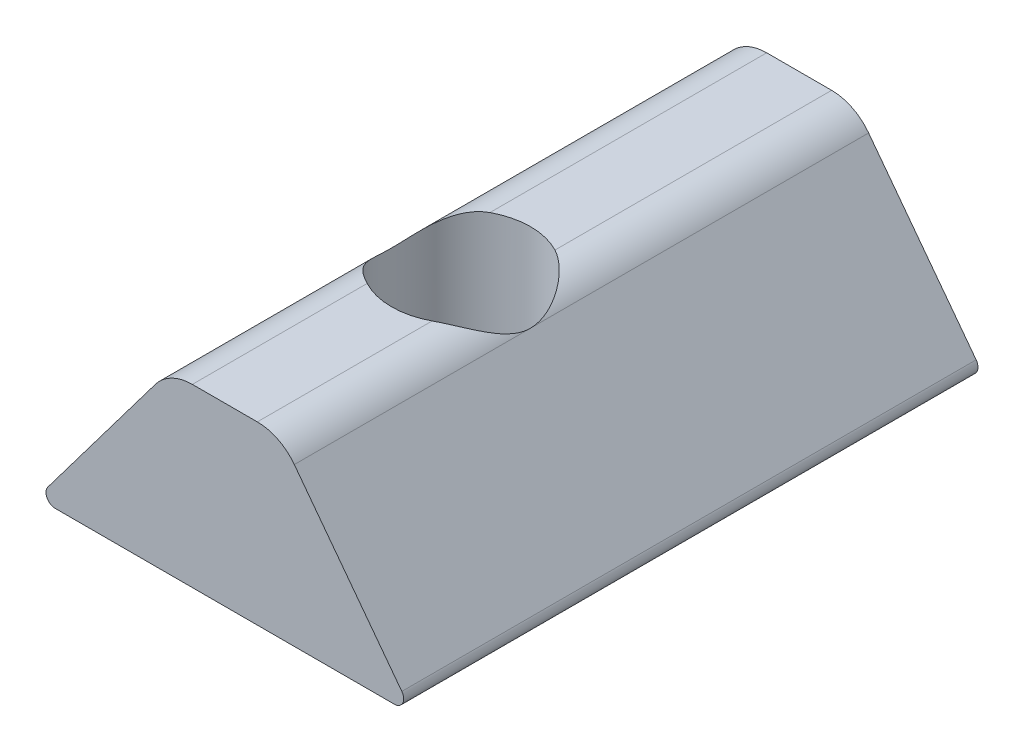
ISO-10303-21;
HEADER;
FILE_DESCRIPTION(('STEP AP214'),'2;1');
FILE_NAME('part.step','',(''),(''),'','','');
FILE_SCHEMA(('AUTOMOTIVE_DESIGN { 1 0 10303 214 1 1 1 1 }'));
ENDSEC;
DATA;
#1=APPLICATION_CONTEXT('core data for automotive mechanical design processes');
#2=APPLICATION_PROTOCOL_DEFINITION('international standard','automotive_design',2000,#1);
#3=PRODUCT_CONTEXT('',#1,'mechanical');
#4=PRODUCT('Part','Part','',(#3));
#5=PRODUCT_RELATED_PRODUCT_CATEGORY('part','',(#4));
#6=PRODUCT_DEFINITION_FORMATION('','',#4);
#7=PRODUCT_DEFINITION_CONTEXT('part definition',#1,'design');
#8=PRODUCT_DEFINITION('design','',#6,#7);
#9=PRODUCT_DEFINITION_SHAPE('','',#8);
#10=(LENGTH_UNIT() NAMED_UNIT(*) SI_UNIT(.MILLI.,.METRE.));
#11=(NAMED_UNIT(*) PLANE_ANGLE_UNIT() SI_UNIT($,.RADIAN.));
#12=(NAMED_UNIT(*) SI_UNIT($,.STERADIAN.) SOLID_ANGLE_UNIT());
#13=UNCERTAINTY_MEASURE_WITH_UNIT(LENGTH_MEASURE(1.E-05),#10,'distance_accuracy_value','');
#14=(GEOMETRIC_REPRESENTATION_CONTEXT(3) GLOBAL_UNCERTAINTY_ASSIGNED_CONTEXT((#13)) GLOBAL_UNIT_ASSIGNED_CONTEXT((#10,
#11,#12)) REPRESENTATION_CONTEXT('',''));
#15=CARTESIAN_POINT('',(0.,0.,0.));
#16=DIRECTION('',(0.,0.,1.));
#17=DIRECTION('',(1.,0.,0.));
#18=AXIS2_PLACEMENT_3D('',#15,#16,#17);
#19=CARTESIAN_POINT('',(0.890667540175902,4.826,-15.748));
#20=DIRECTION('',(0.,1.,0.));
#21=DIRECTION('',(0.,0.,1.));
#22=AXIS2_PLACEMENT_3D('',#19,#20,#21);
#23=PLANE('',#22);
#24=CARTESIAN_POINT('',(0.,4.826,-6.477));
#25=DIRECTION('',(0.,1.,0.));
#26=DIRECTION('',(0.,0.,1.));
#27=AXIS2_PLACEMENT_3D('',#24,#25,#26);
#28=CIRCLE('',#27,1.905);
#29=CARTESIAN_POINT('',(0.890667540175902,4.826,-8.1609644690067));
#30=VERTEX_POINT('',#29);
#31=CARTESIAN_POINT('',(-0.890667540175901,4.826,-8.1609644690067));
#32=VERTEX_POINT('',#31);
#33=EDGE_CURVE('E224',#30,#32,#28,.T.);
#34=ORIENTED_EDGE('',*,*,#33,.F.);
#35=DIRECTION('',(0.,0.,1.));
#36=VECTOR('',#35,1.);
#37=CARTESIAN_POINT('',(0.890667540175902,4.826,-15.748));
#38=LINE('',#37,#36);
#39=CARTESIAN_POINT('',(0.890667540175902,4.826,-15.748));
#40=VERTEX_POINT('',#39);
#41=EDGE_CURVE('E180',#40,#30,#38,.T.);
#42=ORIENTED_EDGE('',*,*,#41,.F.);
#43=DIRECTION('',(-1.,0.,0.));
#44=VECTOR('',#43,1.);
#45=CARTESIAN_POINT('',(0.890667540175902,4.826,-15.748));
#46=LINE('',#45,#44);
#47=CARTESIAN_POINT('',(-0.890667540175901,4.826,-15.748));
#48=VERTEX_POINT('',#47);
#49=EDGE_CURVE('E145',#40,#48,#46,.T.);
#50=ORIENTED_EDGE('',*,*,#49,.T.);
#51=DIRECTION('',(0.,0.,1.));
#52=VECTOR('',#51,1.);
#53=CARTESIAN_POINT('',(-0.890667540175901,4.826,-15.748));
#54=LINE('',#53,#52);
#55=EDGE_CURVE('E176',#48,#32,#54,.T.);
#56=ORIENTED_EDGE('',*,*,#55,.T.);
#57=EDGE_LOOP('',(#34,#42,#50,#56));
#58=FACE_BOUND('',#57,.T.);
#59=ADVANCED_FACE('F35',(#58),#23,.T.);
#60=CARTESIAN_POINT('',(4.6500374554036,0.254000000000002,-15.748));
#61=DIRECTION('',(0.,0.,1.));
#62=DIRECTION('',(1.,0.,0.));
#63=AXIS2_PLACEMENT_3D('',#60,#61,#62);
#64=CYLINDRICAL_SURFACE('',#63,0.254);
#65=CARTESIAN_POINT('',(4.6500374554036,0.254000000000002,0.));
#66=DIRECTION('',(0.,0.,1.));
#67=DIRECTION('',(1.,0.,0.));
#68=AXIS2_PLACEMENT_3D('',#65,#66,#67);
#69=CIRCLE('',#68,0.254);
#70=CARTESIAN_POINT('',(4.6500374554036,0.,0.));
#71=VERTEX_POINT('',#70);
#72=CARTESIAN_POINT('',(4.85291667091559,0.406826777474499,0.));
#73=VERTEX_POINT('',#72);
#74=EDGE_CURVE('E150',#71,#73,#69,.T.);
#75=ORIENTED_EDGE('',*,*,#74,.F.);
#76=DIRECTION('',(0.,0.,1.));
#77=VECTOR('',#76,1.);
#78=CARTESIAN_POINT('',(4.6500374554036,0.,-15.748));
#79=LINE('',#78,#77);
#80=CARTESIAN_POINT('',(4.6500374554036,0.,-15.748));
#81=VERTEX_POINT('',#80);
#82=EDGE_CURVE('E48',#81,#71,#79,.T.);
#83=ORIENTED_EDGE('',*,*,#82,.F.);
#84=CARTESIAN_POINT('',(4.6500374554036,0.254000000000002,-15.748));
#85=DIRECTION('',(0.,0.,1.));
#86=DIRECTION('',(1.,0.,0.));
#87=AXIS2_PLACEMENT_3D('',#84,#85,#86);
#88=CIRCLE('',#87,0.254);
#89=CARTESIAN_POINT('',(4.85291667091559,0.406826777474499,-15.748));
#90=VERTEX_POINT('',#89);
#91=EDGE_CURVE('E172',#81,#90,#88,.T.);
#92=ORIENTED_EDGE('',*,*,#91,.T.);
#93=DIRECTION('',(0.,0.,1.));
#94=VECTOR('',#93,1.);
#95=CARTESIAN_POINT('',(4.85291667091559,0.406826777474499,-15.748));
#96=LINE('',#95,#94);
#97=EDGE_CURVE('E101',#90,#73,#96,.T.);
#98=ORIENTED_EDGE('',*,*,#97,.T.);
#99=EDGE_LOOP('',(#75,#83,#92,#98));
#100=FACE_BOUND('',#99,.T.);
#101=ADVANCED_FACE('F37',(#100),#64,.T.);
#102=CARTESIAN_POINT('',(-4.6500374554036,0.,-15.748));
#103=DIRECTION('',(0.,-1.,0.));
#104=DIRECTION('',(1.,0.,0.));
#105=AXIS2_PLACEMENT_3D('',#102,#103,#104);
#106=PLANE('',#105);
#107=CARTESIAN_POINT('',(0.,0.,-6.477));
#108=DIRECTION('',(0.,-1.,0.));
#109=DIRECTION('',(1.,0.,0.));
#110=AXIS2_PLACEMENT_3D('',#107,#108,#109);
#111=CIRCLE('',#110,1.905);
#112=CARTESIAN_POINT('',(1.905,0.,-6.477));
#113=VERTEX_POINT('',#112);
#114=EDGE_CURVE('E225',#113,#113,#111,.T.);
#115=ORIENTED_EDGE('',*,*,#114,.F.);
#116=EDGE_LOOP('',(#115));
#117=FACE_BOUND('',#116,.T.);
#118=DIRECTION('',(1.,0.,0.));
#119=VECTOR('',#118,1.);
#120=CARTESIAN_POINT('',(-4.6500374554036,0.,0.));
#121=LINE('',#120,#119);
#122=CARTESIAN_POINT('',(-4.6500374554036,0.,0.));
#123=VERTEX_POINT('',#122);
#124=EDGE_CURVE('E169',#123,#71,#121,.T.);
#125=ORIENTED_EDGE('',*,*,#124,.F.);
#126=DIRECTION('',(0.,0.,1.));
#127=VECTOR('',#126,1.);
#128=CARTESIAN_POINT('',(-4.6500374554036,0.,-15.748));
#129=LINE('',#128,#127);
#130=CARTESIAN_POINT('',(-4.6500374554036,0.,-15.748));
#131=VERTEX_POINT('',#130);
#132=EDGE_CURVE('E131',#131,#123,#129,.T.);
#133=ORIENTED_EDGE('',*,*,#132,.F.);
#134=DIRECTION('',(1.,0.,0.));
#135=VECTOR('',#134,1.);
#136=CARTESIAN_POINT('',(-4.6500374554036,0.,-15.748));
#137=LINE('',#136,#135);
#138=EDGE_CURVE('E140',#131,#81,#137,.T.);
#139=ORIENTED_EDGE('',*,*,#138,.T.);
#140=ORIENTED_EDGE('',*,*,#82,.T.);
#141=EDGE_LOOP('',(#125,#133,#139,#140));
#142=FACE_BOUND('',#141,.T.);
#143=ADVANCED_FACE('F189',(#117,#142),#106,.T.);
#144=CARTESIAN_POINT('',(-4.6500374554036,0.254,-15.748));
#145=DIRECTION('',(0.,0.,1.));
#146=DIRECTION('',(1.,0.,0.));
#147=AXIS2_PLACEMENT_3D('',#144,#145,#146);
#148=CYLINDRICAL_SURFACE('',#147,0.254);
#149=CARTESIAN_POINT('',(-4.6500374554036,0.254,0.));
#150=DIRECTION('',(0.,0.,1.));
#151=DIRECTION('',(-1.,0.,0.));
#152=AXIS2_PLACEMENT_3D('',#149,#150,#151);
#153=CIRCLE('',#152,0.254);
#154=CARTESIAN_POINT('',(-4.85291667091559,0.406826777474498,0.));
#155=VERTEX_POINT('',#154);
#156=EDGE_CURVE('E126',#155,#123,#153,.T.);
#157=ORIENTED_EDGE('',*,*,#156,.F.);
#158=DIRECTION('',(0.,0.,1.));
#159=VECTOR('',#158,1.);
#160=CARTESIAN_POINT('',(-4.85291667091559,0.406826777474498,-15.748));
#161=LINE('',#160,#159);
#162=CARTESIAN_POINT('',(-4.85291667091559,0.406826777474498,-15.748));
#163=VERTEX_POINT('',#162);
#164=EDGE_CURVE('E120',#163,#155,#161,.T.);
#165=ORIENTED_EDGE('',*,*,#164,.F.);
#166=CARTESIAN_POINT('',(-4.6500374554036,0.254,-15.748));
#167=DIRECTION('',(0.,0.,1.));
#168=DIRECTION('',(-1.,0.,0.));
#169=AXIS2_PLACEMENT_3D('',#166,#167,#168);
#170=CIRCLE('',#169,0.254);
#171=EDGE_CURVE('E123',#163,#131,#170,.T.);
#172=ORIENTED_EDGE('',*,*,#171,.T.);
#173=ORIENTED_EDGE('',*,*,#132,.T.);
#174=EDGE_LOOP('',(#157,#165,#172,#173));
#175=FACE_BOUND('',#174,.T.);
#176=ADVANCED_FACE('F122',(#175),#148,.T.);
#177=CARTESIAN_POINT('',(-1.90506361773587,4.32013388737246,-15.748));
#178=DIRECTION('',(-0.798737068944852,0.601680226277536,0.));
#179=DIRECTION('',(-0.601680226277536,-0.798737068944852,0.));
#180=AXIS2_PLACEMENT_3D('',#177,#178,#179);
#181=PLANE('',#180);
#182=DIRECTION('',(-0.601680226277536,-0.798737068944852,0.));
#183=VECTOR('',#182,1.);
#184=CARTESIAN_POINT('',(-1.90506361773587,4.32013388737246,0.));
#185=LINE('',#184,#183);
#186=CARTESIAN_POINT('',(-1.90506361773587,4.32013388737246,0.));
#187=VERTEX_POINT('',#186);
#188=EDGE_CURVE('E166',#187,#155,#185,.T.);
#189=ORIENTED_EDGE('',*,*,#188,.F.);
#190=DIRECTION('',(0.,0.,1.));
#191=VECTOR('',#190,1.);
#192=CARTESIAN_POINT('',(-1.90506361773587,4.32013388737246,-15.748));
#193=LINE('',#192,#191);
#194=CARTESIAN_POINT('',(-1.90506361773587,4.32013388737246,-15.748));
#195=VERTEX_POINT('',#194);
#196=EDGE_CURVE('E132',#195,#187,#193,.T.);
#197=ORIENTED_EDGE('',*,*,#196,.F.);
#198=DIRECTION('',(-0.601680226277536,-0.798737068944852,0.));
#199=VECTOR('',#198,1.);
#200=CARTESIAN_POINT('',(-1.90506361773587,4.32013388737246,-15.748));
#201=LINE('',#200,#199);
#202=EDGE_CURVE('E138',#195,#163,#201,.T.);
#203=ORIENTED_EDGE('',*,*,#202,.T.);
#204=ORIENTED_EDGE('',*,*,#164,.T.);
#205=EDGE_LOOP('',(#189,#197,#203,#204));
#206=FACE_BOUND('',#205,.T.);
#207=ADVANCED_FACE('F142',(#206),#181,.T.);
#208=CARTESIAN_POINT('',(-0.890667540175907,3.556,-15.748));
#209=DIRECTION('',(0.,0.,1.));
#210=DIRECTION('',(1.,0.,0.));
#211=AXIS2_PLACEMENT_3D('',#208,#209,#210);
#212=CYLINDRICAL_SURFACE('',#211,1.27);
#213=CARTESIAN_POINT('',(-0.890667540175901,4.826,-8.1609644690067));
#214=CARTESIAN_POINT('',(-0.927892024985748,4.8260018007794,-8.14128356028125));
#215=CARTESIAN_POINT('',(-0.964418720392958,4.82436389491444,-8.12037691583388));
#216=CARTESIAN_POINT('',(-1.03577544387642,4.81818954496715,-8.07635701270208));
#217=CARTESIAN_POINT('',(-1.07060843201175,4.81365836886368,-8.05324782925824));
#218=CARTESIAN_POINT('',(-1.17150727910803,4.79642242128297,-7.98144378313409));
#219=CARTESIAN_POINT('',(-1.2348700793564,4.78005660667843,-7.92979335111626));
#220=CARTESIAN_POINT('',(-1.36983691991808,4.73485169458184,-7.80487594395838));
#221=CARTESIAN_POINT('',(-1.43879942761695,4.7038054234451,-7.72960076700754));
#222=CARTESIAN_POINT('',(-1.56327026273931,4.63561622182929,-7.57039118259843));
#223=CARTESIAN_POINT('',(-1.61868431637519,4.59843342876795,-7.48640158723667));
#224=CARTESIAN_POINT('',(-1.7170130927017,4.52243678309632,-7.30858525033271));
#225=CARTESIAN_POINT('',(-1.75953254592996,4.48360646593536,-7.21454831136995));
#226=CARTESIAN_POINT('',(-1.82927993477528,4.41294545106331,-7.01871935918104));
#227=CARTESIAN_POINT('',(-1.85658737125877,4.38107890140676,-6.91697088312635));
#228=CARTESIAN_POINT('',(-1.88721559587186,4.3435028943829,-6.74528050078586));
#229=CARTESIAN_POINT('',(-1.89567113078766,4.33247915903457,-6.67747748531012));
#230=CARTESIAN_POINT('',(-1.90516881540749,4.32004025079029,-6.54056001681234));
#231=CARTESIAN_POINT('',(-1.90622894828803,4.31860177010132,-6.47144915508953));
#232=CARTESIAN_POINT('',(-1.90088067888201,4.32566371044529,-6.33417204145713));
#233=CARTESIAN_POINT('',(-1.89448182146615,4.33415142949696,-6.26600469502725));
#234=CARTESIAN_POINT('',(-1.87473565838304,4.35896320550031,-6.13202791976209));
#235=CARTESIAN_POINT('',(-1.86136578709011,4.37531269808048,-6.06622689476432));
#236=CARTESIAN_POINT('',(-1.83157011056984,4.40923242451676,-5.95049275706526));
#237=CARTESIAN_POINT('',(-1.81627007049798,4.42592317591598,-5.89999324500331));
#238=CARTESIAN_POINT('',(-1.7817973581003,4.4612059968105,-5.80100604605027));
#239=CARTESIAN_POINT('',(-1.76262251825544,4.4797991275886,-5.75251950357241));
#240=CARTESIAN_POINT('',(-1.69936960584768,4.53687691736266,-5.60979452978428));
#241=CARTESIAN_POINT('',(-1.64962183739217,4.57658459235769,-5.51851388280088));
#242=CARTESIAN_POINT('',(-1.53246579633139,4.65426030371299,-5.34014908324353));
#243=CARTESIAN_POINT('',(-1.46435596488952,4.69206657531061,-5.25344579411852));
#244=CARTESIAN_POINT('',(-1.35018516996071,4.74067006481378,-5.13197612885872));
#245=CARTESIAN_POINT('',(-1.31024787175948,4.75549181326045,-5.09300841775592));
#246=CARTESIAN_POINT('',(-1.22646432030552,4.78158662342648,-5.01824796707735));
#247=CARTESIAN_POINT('',(-1.18262215897196,4.79286334512828,-4.98245198053775));
#248=CARTESIAN_POINT('',(-1.09836952766908,4.80951731597096,-4.91978520495573));
#249=CARTESIAN_POINT('',(-1.0584780695011,4.8155374948844,-4.8923905007658));
#250=CARTESIAN_POINT('',(-0.976270743871235,4.82378946222203,-4.84044550918259));
#251=CARTESIAN_POINT('',(-0.933944897823254,4.82600431037527,-4.81590839196257));
#252=CARTESIAN_POINT('',(-0.890667540175902,4.826,-4.7930355309933));
#253=B_SPLINE_CURVE_WITH_KNOTS('',3,(#213,#214,#215,#216,#217,#218,#219,#220,#221,#222,#223,
#224,#225,#226,#227,#228,#229,#230,#231,#232,#233,#234,#235,#236,#237,#238,#239,#240,#241,#242,
#243,#244,#245,#246,#247,#248,#249,#250,#251,#252),.UNSPECIFIED.,.F.,.F.,(4,2,2,2,2,2,2,2,2,2,2,
2,2,2,2,2,2,2,2,4),(0.,0.126195120147943,0.252161120710387,0.501088000904963,0.819544509405889,
1.14015759341489,1.46978571121161,1.79767456896152,2.00441096161018,2.21064446380945,
2.41661434947659,2.62325515090506,2.78906680686339,2.95497147402589,3.28750056930121,
3.635184969076,3.80812002490823,3.98087594700512,4.12689528059429,4.27356298326871),.UNSPECIFIED.);
#254=CARTESIAN_POINT('',(-0.890667540175901,4.826,-4.7930355309933));
#255=VERTEX_POINT('',#254);
#256=EDGE_CURVE('E154',#32,#255,#253,.T.);
#257=ORIENTED_EDGE('',*,*,#256,.F.);
#258=ORIENTED_EDGE('',*,*,#55,.F.);
#259=CARTESIAN_POINT('',(-0.890667540175907,3.556,-15.748));
#260=DIRECTION('',(0.,0.,1.));
#261=DIRECTION('',(1.,0.,0.));
#262=AXIS2_PLACEMENT_3D('',#259,#260,#261);
#263=CIRCLE('',#262,1.27);
#264=EDGE_CURVE('E143',#48,#195,#263,.T.);
#265=ORIENTED_EDGE('',*,*,#264,.T.);
#266=ORIENTED_EDGE('',*,*,#196,.T.);
#267=CARTESIAN_POINT('',(-0.890667540175907,3.556,0.));
#268=DIRECTION('',(0.,0.,1.));
#269=DIRECTION('',(1.,0.,0.));
#270=AXIS2_PLACEMENT_3D('',#267,#268,#269);
#271=CIRCLE('',#270,1.27);
#272=CARTESIAN_POINT('',(-0.890667540175901,4.826,0.));
#273=VERTEX_POINT('',#272);
#274=EDGE_CURVE('E163',#273,#187,#271,.T.);
#275=ORIENTED_EDGE('',*,*,#274,.F.);
#276=EDGE_CURVE('E179',#255,#273,#54,.T.);
#277=ORIENTED_EDGE('',*,*,#276,.F.);
#278=EDGE_LOOP('',(#257,#258,#265,#266,#275,#277));
#279=FACE_BOUND('',#278,.T.);
#280=ADVANCED_FACE('F210',(#279),#212,.T.);
#281=CARTESIAN_POINT('',(0.890667540175902,4.826,-4.7930355309933));
#282=VERTEX_POINT('',#281);
#283=EDGE_CURVE('E54',#255,#282,#28,.T.);
#284=ORIENTED_EDGE('',*,*,#283,.F.);
#285=ORIENTED_EDGE('',*,*,#276,.T.);
#286=DIRECTION('',(-1.,0.,0.));
#287=VECTOR('',#286,1.);
#288=CARTESIAN_POINT('',(0.890667540175902,4.826,0.));
#289=LINE('',#288,#287);
#290=CARTESIAN_POINT('',(0.890667540175902,4.826,0.));
#291=VERTEX_POINT('',#290);
#292=EDGE_CURVE('E160',#291,#273,#289,.T.);
#293=ORIENTED_EDGE('',*,*,#292,.F.);
#294=EDGE_CURVE('E183',#282,#291,#38,.T.);
#295=ORIENTED_EDGE('',*,*,#294,.F.);
#296=EDGE_LOOP('',(#284,#285,#293,#295));
#297=FACE_BOUND('',#296,.T.);
#298=ADVANCED_FACE('F203',(#297),#23,.T.);
#299=CARTESIAN_POINT('',(0.890667540175907,3.556,-15.748));
#300=DIRECTION('',(0.,0.,1.));
#301=DIRECTION('',(1.,0.,0.));
#302=AXIS2_PLACEMENT_3D('',#299,#300,#301);
#303=CYLINDRICAL_SURFACE('',#302,1.27);
#304=CARTESIAN_POINT('',(0.890667540175902,4.826,-4.7930355309933));
#305=CARTESIAN_POINT('',(0.927892024985749,4.8260018007794,-4.81271643971874));
#306=CARTESIAN_POINT('',(0.964418720392959,4.82436389491444,-4.83362308416612));
#307=CARTESIAN_POINT('',(1.03577544387642,4.81818954496715,-4.87764298729792));
#308=CARTESIAN_POINT('',(1.07060843201175,4.81365836886368,-4.90075217074176));
#309=CARTESIAN_POINT('',(1.17150727910803,4.79642242128297,-4.97255621686591));
#310=CARTESIAN_POINT('',(1.2348700793564,4.78005660667843,-5.02420664888374));
#311=CARTESIAN_POINT('',(1.36983691991808,4.73485169458184,-5.14912405604162));
#312=CARTESIAN_POINT('',(1.43879942761695,4.7038054234451,-5.22439923299246));
#313=CARTESIAN_POINT('',(1.56327026273931,4.63561622182929,-5.38360881740158));
#314=CARTESIAN_POINT('',(1.61868431637519,4.59843342876795,-5.46759841276333));
#315=CARTESIAN_POINT('',(1.7170130927017,4.52243678309632,-5.64541474966729));
#316=CARTESIAN_POINT('',(1.75953254592996,4.48360646593536,-5.73945168863005));
#317=CARTESIAN_POINT('',(1.82927993477528,4.41294545106331,-5.93528064081896));
#318=CARTESIAN_POINT('',(1.85658737125877,4.38107890140676,-6.03702911687366));
#319=CARTESIAN_POINT('',(1.88721559587186,4.3435028943829,-6.20871949921414));
#320=CARTESIAN_POINT('',(1.89567113078766,4.33247915903457,-6.27652251468988));
#321=CARTESIAN_POINT('',(1.90516881540749,4.32004025079029,-6.41343998318766));
#322=CARTESIAN_POINT('',(1.90622894828803,4.31860177010132,-6.48255084491048));
#323=CARTESIAN_POINT('',(1.90088067888201,4.3256637104453,-6.61982795854288));
#324=CARTESIAN_POINT('',(1.89448182146615,4.33415142949696,-6.68799530497275));
#325=CARTESIAN_POINT('',(1.87473565838304,4.35896320550031,-6.82197208023791));
#326=CARTESIAN_POINT('',(1.86136578709011,4.37531269808048,-6.88777310523568));
#327=CARTESIAN_POINT('',(1.83157011056984,4.40923242451676,-7.00350724293475));
#328=CARTESIAN_POINT('',(1.81627007049797,4.42592317591599,-7.0540067549967));
#329=CARTESIAN_POINT('',(1.7817973581003,4.46120599681051,-7.15299395394973));
#330=CARTESIAN_POINT('',(1.76262251825544,4.47979912758861,-7.20148049642759));
#331=CARTESIAN_POINT('',(1.69936960584768,4.53687691736266,-7.34420547021573));
#332=CARTESIAN_POINT('',(1.64962183739217,4.5765845923577,-7.43548611719913));
#333=CARTESIAN_POINT('',(1.53246579633139,4.65426030371299,-7.61385091675647));
#334=CARTESIAN_POINT('',(1.46435596488952,4.69206657531062,-7.70055420588149));
#335=CARTESIAN_POINT('',(1.35018516996071,4.74067006481378,-7.82202387114128));
#336=CARTESIAN_POINT('',(1.31024787175947,4.75549181326045,-7.86099158224408));
#337=CARTESIAN_POINT('',(1.22646432030551,4.78158662342649,-7.93575203292265));
#338=CARTESIAN_POINT('',(1.18262215897196,4.79286334512828,-7.97154801946226));
#339=CARTESIAN_POINT('',(1.09836952766907,4.80951731597096,-8.03421479504427));
#340=CARTESIAN_POINT('',(1.05847806950109,4.8155374948844,-8.06160949923421));
#341=CARTESIAN_POINT('',(0.976270743871231,4.82378946222203,-8.11355449081741));
#342=CARTESIAN_POINT('',(0.933944897823252,4.82600431037527,-8.13809160803743));
#343=CARTESIAN_POINT('',(0.890667540175901,4.826,-8.1609644690067));
#344=B_SPLINE_CURVE_WITH_KNOTS('',3,(#304,#305,#306,#307,#308,#309,#310,#311,#312,#313,#314,
#315,#316,#317,#318,#319,#320,#321,#322,#323,#324,#325,#326,#327,#328,#329,#330,#331,#332,#333,
#334,#335,#336,#337,#338,#339,#340,#341,#342,#343),.UNSPECIFIED.,.F.,.F.,(4,2,2,2,2,2,2,2,2,2,2,
2,2,2,2,2,2,2,2,4),(0.,0.126195120147941,0.252161120710387,0.501088000904963,0.819544509405889,
1.14015759341489,1.46978571121162,1.79767456896152,2.00441096161018,2.21064446380946,
2.4166143494766,2.62325515090506,2.78906680686339,2.95497147402589,3.28750056930122,
3.63518496907601,3.80812002490824,3.98087594700512,4.12689528059429,4.2735629832687),.UNSPECIFIED.);
#345=EDGE_CURVE('E11',#282,#30,#344,.T.);
#346=ORIENTED_EDGE('',*,*,#345,.F.);
#347=ORIENTED_EDGE('',*,*,#294,.T.);
#348=CARTESIAN_POINT('',(0.890667540175907,3.556,0.));
#349=DIRECTION('',(0.,0.,1.));
#350=DIRECTION('',(1.,0.,0.));
#351=AXIS2_PLACEMENT_3D('',#348,#349,#350);
#352=CIRCLE('',#351,1.27);
#353=CARTESIAN_POINT('',(1.90506361773587,4.32013388737247,0.));
#354=VERTEX_POINT('',#353);
#355=EDGE_CURVE('E157',#354,#291,#352,.T.);
#356=ORIENTED_EDGE('',*,*,#355,.F.);
#357=DIRECTION('',(0.,0.,1.));
#358=VECTOR('',#357,1.);
#359=CARTESIAN_POINT('',(1.90506361773587,4.32013388737247,-15.748));
#360=LINE('',#359,#358);
#361=CARTESIAN_POINT('',(1.90506361773587,4.32013388737247,-15.748));
#362=VERTEX_POINT('',#361);
#363=EDGE_CURVE('E184',#362,#354,#360,.T.);
#364=ORIENTED_EDGE('',*,*,#363,.F.);
#365=CARTESIAN_POINT('',(0.890667540175907,3.556,-15.748));
#366=DIRECTION('',(0.,0.,1.));
#367=DIRECTION('',(1.,0.,0.));
#368=AXIS2_PLACEMENT_3D('',#365,#366,#367);
#369=CIRCLE('',#368,1.27);
#370=EDGE_CURVE('E322',#362,#40,#369,.T.);
#371=ORIENTED_EDGE('',*,*,#370,.T.);
#372=ORIENTED_EDGE('',*,*,#41,.T.);
#373=EDGE_LOOP('',(#346,#347,#356,#364,#371,#372));
#374=FACE_BOUND('',#373,.T.);
#375=ADVANCED_FACE('F209',(#374),#303,.T.);
#376=CARTESIAN_POINT('',(4.85291667091559,0.406826777474499,-15.748));
#377=DIRECTION('',(0.798737068944852,0.601680226277537,0.));
#378=DIRECTION('',(-0.601680226277537,0.798737068944852,0.));
#379=AXIS2_PLACEMENT_3D('',#376,#377,#378);
#380=PLANE('',#379);
#381=DIRECTION('',(-0.601680226277536,0.798737068944852,0.));
#382=VECTOR('',#381,1.);
#383=CARTESIAN_POINT('',(4.85291667091559,0.406826777474499,0.));
#384=LINE('',#383,#382);
#385=EDGE_CURVE('E153',#73,#354,#384,.T.);
#386=ORIENTED_EDGE('',*,*,#385,.F.);
#387=ORIENTED_EDGE('',*,*,#97,.F.);
#388=DIRECTION('',(-0.601680226277536,0.798737068944852,0.));
#389=VECTOR('',#388,1.);
#390=CARTESIAN_POINT('',(4.85291667091559,0.406826777474499,-15.748));
#391=LINE('',#390,#389);
#392=EDGE_CURVE('E320',#90,#362,#391,.T.);
#393=ORIENTED_EDGE('',*,*,#392,.T.);
#394=ORIENTED_EDGE('',*,*,#363,.T.);
#395=EDGE_LOOP('',(#386,#387,#393,#394));
#396=FACE_BOUND('',#395,.T.);
#397=ADVANCED_FACE('F185',(#396),#380,.T.);
#398=CARTESIAN_POINT('',(4.6500374554036,0.254000000000002,-15.748));
#399=DIRECTION('',(0.,0.,1.));
#400=DIRECTION('',(1.,0.,0.));
#401=AXIS2_PLACEMENT_3D('',#398,#399,#400);
#402=PLANE('',#401);
#403=ORIENTED_EDGE('',*,*,#91,.F.);
#404=ORIENTED_EDGE('',*,*,#138,.F.);
#405=ORIENTED_EDGE('',*,*,#171,.F.);
#406=ORIENTED_EDGE('',*,*,#202,.F.);
#407=ORIENTED_EDGE('',*,*,#264,.F.);
#408=ORIENTED_EDGE('',*,*,#49,.F.);
#409=ORIENTED_EDGE('',*,*,#370,.F.);
#410=ORIENTED_EDGE('',*,*,#392,.F.);
#411=EDGE_LOOP('',(#403,#404,#405,#406,#407,#408,#409,#410));
#412=FACE_BOUND('',#411,.T.);
#413=ADVANCED_FACE('F136',(#412),#402,.F.);
#414=CARTESIAN_POINT('',(4.6500374554036,0.254000000000002,0.));
#415=DIRECTION('',(0.,0.,1.));
#416=DIRECTION('',(1.,0.,0.));
#417=AXIS2_PLACEMENT_3D('',#414,#415,#416);
#418=PLANE('',#417);
#419=ORIENTED_EDGE('',*,*,#74,.T.);
#420=ORIENTED_EDGE('',*,*,#385,.T.);
#421=ORIENTED_EDGE('',*,*,#355,.T.);
#422=ORIENTED_EDGE('',*,*,#292,.T.);
#423=ORIENTED_EDGE('',*,*,#274,.T.);
#424=ORIENTED_EDGE('',*,*,#188,.T.);
#425=ORIENTED_EDGE('',*,*,#156,.T.);
#426=ORIENTED_EDGE('',*,*,#124,.T.);
#427=EDGE_LOOP('',(#419,#420,#421,#422,#423,#424,#425,#426));
#428=FACE_BOUND('',#427,.T.);
#429=ADVANCED_FACE('F188',(#428),#418,.T.);
#430=CARTESIAN_POINT('',(0.,7.62,-6.477));
#431=DIRECTION('',(0.,-1.,0.));
#432=DIRECTION('',(1.,0.,0.));
#433=AXIS2_PLACEMENT_3D('',#430,#431,#432);
#434=CYLINDRICAL_SURFACE('',#433,1.905);
#435=ORIENTED_EDGE('',*,*,#256,.T.);
#436=ORIENTED_EDGE('',*,*,#283,.T.);
#437=ORIENTED_EDGE('',*,*,#345,.T.);
#438=ORIENTED_EDGE('',*,*,#33,.T.);
#439=EDGE_LOOP('',(#435,#436,#437,#438));
#440=FACE_BOUND('',#439,.T.);
#441=ORIENTED_EDGE('',*,*,#114,.T.);
#442=EDGE_LOOP('',(#441));
#443=FACE_BOUND('',#442,.T.);
#444=ADVANCED_FACE('F231',(#440,#443),#434,.F.);
#445=CLOSED_SHELL('',(#59,#101,#143,#176,#207,#280,#298,#375,#397,#413,#429,#444));
#446=MANIFOLD_SOLID_BREP('B2',#445);
#447=ADVANCED_BREP_SHAPE_REPRESENTATION('',(#18,#446),#14);
#448=SHAPE_DEFINITION_REPRESENTATION(#9,#447);
ENDSEC;
END-ISO-10303-21;
